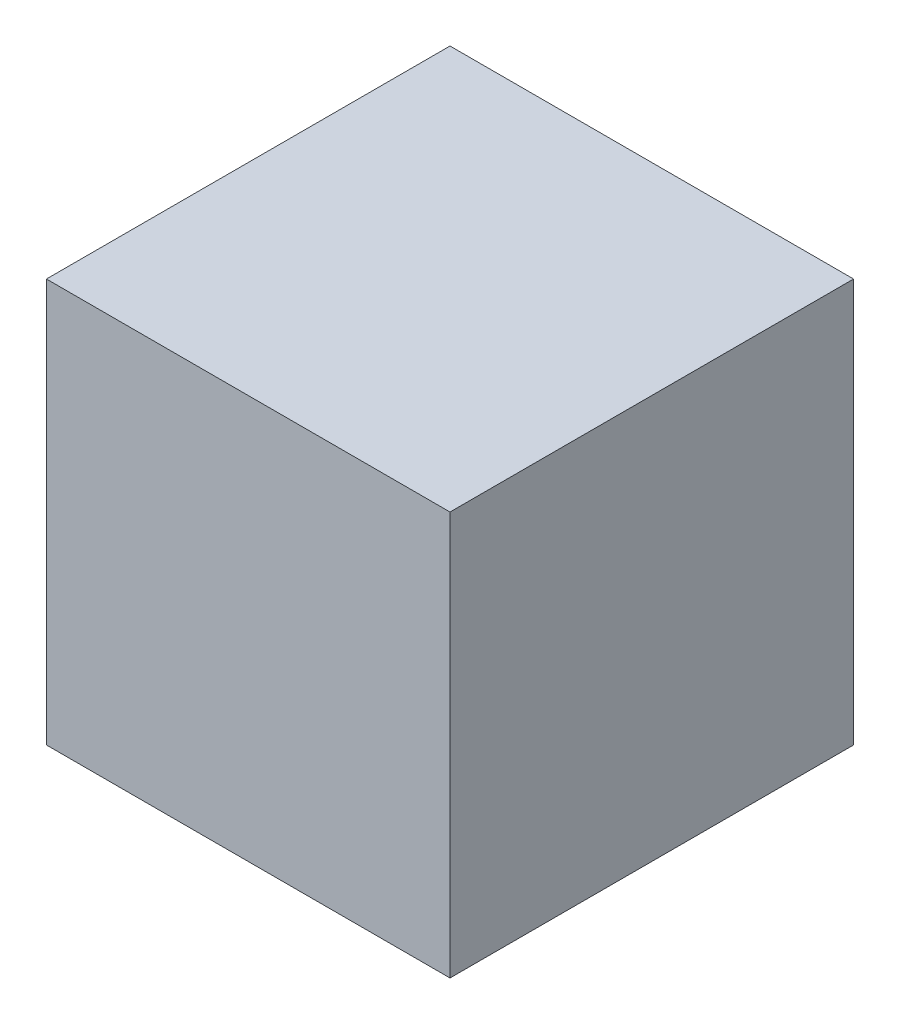
ISO-10303-21;
HEADER;
FILE_DESCRIPTION(('STEP AP214'),'2;1');
FILE_NAME('part.step','',(''),(''),'','','');
FILE_SCHEMA(('AUTOMOTIVE_DESIGN { 1 0 10303 214 1 1 1 1 }'));
ENDSEC;
DATA;
#1=APPLICATION_CONTEXT('core data for automotive mechanical design processes');
#2=APPLICATION_PROTOCOL_DEFINITION('international standard','automotive_design',2000,#1);
#3=PRODUCT_CONTEXT('',#1,'mechanical');
#4=PRODUCT('Part','Part','',(#3));
#5=PRODUCT_RELATED_PRODUCT_CATEGORY('part','',(#4));
#6=PRODUCT_DEFINITION_FORMATION('','',#4);
#7=PRODUCT_DEFINITION_CONTEXT('part definition',#1,'design');
#8=PRODUCT_DEFINITION('design','',#6,#7);
#9=PRODUCT_DEFINITION_SHAPE('','',#8);
#10=(LENGTH_UNIT() NAMED_UNIT(*) SI_UNIT(.MILLI.,.METRE.));
#11=(NAMED_UNIT(*) PLANE_ANGLE_UNIT() SI_UNIT($,.RADIAN.));
#12=(NAMED_UNIT(*) SI_UNIT($,.STERADIAN.) SOLID_ANGLE_UNIT());
#13=UNCERTAINTY_MEASURE_WITH_UNIT(LENGTH_MEASURE(1.E-05),#10,'distance_accuracy_value','');
#14=(GEOMETRIC_REPRESENTATION_CONTEXT(3) GLOBAL_UNCERTAINTY_ASSIGNED_CONTEXT((#13)) GLOBAL_UNIT_ASSIGNED_CONTEXT((#10,
#11,#12)) REPRESENTATION_CONTEXT('',''));
#15=CARTESIAN_POINT('',(0.,0.,0.));
#16=DIRECTION('',(0.,0.,1.));
#17=DIRECTION('',(1.,0.,0.));
#18=AXIS2_PLACEMENT_3D('',#15,#16,#17);
#19=CARTESIAN_POINT('',(0.05,0.05,0.05));
#20=DIRECTION('',(-1.,0.,0.));
#21=DIRECTION('',(0.,-1.,0.));
#22=AXIS2_PLACEMENT_3D('',#19,#20,#21);
#23=PLANE('',#22);
#24=DIRECTION('',(0.,1.,0.));
#25=VECTOR('',#24,1.);
#26=CARTESIAN_POINT('',(0.05,0.05,-0.05));
#27=LINE('',#26,#25);
#28=CARTESIAN_POINT('',(0.05,-0.0499999999999999,-0.05));
#29=VERTEX_POINT('',#28);
#30=CARTESIAN_POINT('',(0.05,0.05,-0.05));
#31=VERTEX_POINT('',#30);
#32=EDGE_CURVE('E100',#29,#31,#27,.T.);
#33=ORIENTED_EDGE('',*,*,#32,.T.);
#34=DIRECTION('',(0.,0.,-1.));
#35=VECTOR('',#34,1.);
#36=CARTESIAN_POINT('',(0.05,0.05,0.05));
#37=LINE('',#36,#35);
#38=CARTESIAN_POINT('',(0.05,0.05,0.05));
#39=VERTEX_POINT('',#38);
#40=EDGE_CURVE('E11',#39,#31,#37,.T.);
#41=ORIENTED_EDGE('',*,*,#40,.F.);
#42=DIRECTION('',(0.,1.,0.));
#43=VECTOR('',#42,1.);
#44=CARTESIAN_POINT('',(0.05,0.05,0.05));
#45=LINE('',#44,#43);
#46=CARTESIAN_POINT('',(0.05,-0.0499999999999999,0.05));
#47=VERTEX_POINT('',#46);
#48=EDGE_CURVE('E88',#47,#39,#45,.T.);
#49=ORIENTED_EDGE('',*,*,#48,.F.);
#50=DIRECTION('',(0.,0.,-1.));
#51=VECTOR('',#50,1.);
#52=CARTESIAN_POINT('',(0.05,-0.0499999999999999,0.05));
#53=LINE('',#52,#51);
#54=EDGE_CURVE('E96',#47,#29,#53,.T.);
#55=ORIENTED_EDGE('',*,*,#54,.T.);
#56=EDGE_LOOP('',(#33,#41,#49,#55));
#57=FACE_BOUND('',#56,.T.);
#58=ADVANCED_FACE('F37',(#57),#23,.F.);
#59=CARTESIAN_POINT('',(-0.05,0.05,0.05));
#60=DIRECTION('',(0.,-1.,0.));
#61=DIRECTION('',(0.,0.,-1.));
#62=AXIS2_PLACEMENT_3D('',#59,#60,#61);
#63=PLANE('',#62);
#64=DIRECTION('',(-1.,0.,0.));
#65=VECTOR('',#64,1.);
#66=CARTESIAN_POINT('',(-0.05,0.05,-0.05));
#67=LINE('',#66,#65);
#68=CARTESIAN_POINT('',(-0.05,0.05,-0.05));
#69=VERTEX_POINT('',#68);
#70=EDGE_CURVE('E92',#31,#69,#67,.T.);
#71=ORIENTED_EDGE('',*,*,#70,.T.);
#72=DIRECTION('',(0.,0.,-1.));
#73=VECTOR('',#72,1.);
#74=CARTESIAN_POINT('',(-0.05,0.05,0.05));
#75=LINE('',#74,#73);
#76=CARTESIAN_POINT('',(-0.05,0.05,0.05));
#77=VERTEX_POINT('',#76);
#78=EDGE_CURVE('E45',#77,#69,#75,.T.);
#79=ORIENTED_EDGE('',*,*,#78,.F.);
#80=DIRECTION('',(-1.,0.,0.));
#81=VECTOR('',#80,1.);
#82=CARTESIAN_POINT('',(-0.05,0.05,0.05));
#83=LINE('',#82,#81);
#84=EDGE_CURVE('E83',#39,#77,#83,.T.);
#85=ORIENTED_EDGE('',*,*,#84,.F.);
#86=ORIENTED_EDGE('',*,*,#40,.T.);
#87=EDGE_LOOP('',(#71,#79,#85,#86));
#88=FACE_BOUND('',#87,.T.);
#89=ADVANCED_FACE('F91',(#88),#63,.F.);
#90=CARTESIAN_POINT('',(-0.05,0.05,0.05));
#91=DIRECTION('',(1.,0.,0.));
#92=DIRECTION('',(0.,1.,0.));
#93=AXIS2_PLACEMENT_3D('',#90,#91,#92);
#94=PLANE('',#93);
#95=DIRECTION('',(0.,-1.,0.));
#96=VECTOR('',#95,1.);
#97=CARTESIAN_POINT('',(-0.05,0.05,-0.05));
#98=LINE('',#97,#96);
#99=CARTESIAN_POINT('',(-0.05,-0.05,-0.05));
#100=VERTEX_POINT('',#99);
#101=EDGE_CURVE('E70',#69,#100,#98,.T.);
#102=ORIENTED_EDGE('',*,*,#101,.T.);
#103=DIRECTION('',(0.,0.,-1.));
#104=VECTOR('',#103,1.);
#105=CARTESIAN_POINT('',(-0.05,-0.05,0.05));
#106=LINE('',#105,#104);
#107=CARTESIAN_POINT('',(-0.05,-0.05,0.05));
#108=VERTEX_POINT('',#107);
#109=EDGE_CURVE('E93',#108,#100,#106,.T.);
#110=ORIENTED_EDGE('',*,*,#109,.F.);
#111=DIRECTION('',(0.,-1.,0.));
#112=VECTOR('',#111,1.);
#113=CARTESIAN_POINT('',(-0.05,0.05,0.05));
#114=LINE('',#113,#112);
#115=EDGE_CURVE('E86',#77,#108,#114,.T.);
#116=ORIENTED_EDGE('',*,*,#115,.F.);
#117=ORIENTED_EDGE('',*,*,#78,.T.);
#118=EDGE_LOOP('',(#102,#110,#116,#117));
#119=FACE_BOUND('',#118,.T.);
#120=ADVANCED_FACE('F94',(#119),#94,.F.);
#121=CARTESIAN_POINT('',(-0.05,-0.05,0.05));
#122=DIRECTION('',(0.,1.,0.));
#123=DIRECTION('',(-1.,0.,0.));
#124=AXIS2_PLACEMENT_3D('',#121,#122,#123);
#125=PLANE('',#124);
#126=DIRECTION('',(1.,0.,0.));
#127=VECTOR('',#126,1.);
#128=CARTESIAN_POINT('',(-0.05,-0.05,-0.05));
#129=LINE('',#128,#127);
#130=EDGE_CURVE('E76',#100,#29,#129,.T.);
#131=ORIENTED_EDGE('',*,*,#130,.T.);
#132=ORIENTED_EDGE('',*,*,#54,.F.);
#133=DIRECTION('',(1.,0.,0.));
#134=VECTOR('',#133,1.);
#135=CARTESIAN_POINT('',(-0.05,-0.05,0.05));
#136=LINE('',#135,#134);
#137=EDGE_CURVE('E53',#108,#47,#136,.T.);
#138=ORIENTED_EDGE('',*,*,#137,.F.);
#139=ORIENTED_EDGE('',*,*,#109,.T.);
#140=EDGE_LOOP('',(#131,#132,#138,#139));
#141=FACE_BOUND('',#140,.T.);
#142=ADVANCED_FACE('F107',(#141),#125,.F.);
#143=CARTESIAN_POINT('',(0.,0.,0.05));
#144=DIRECTION('',(0.,0.,1.));
#145=DIRECTION('',(1.,0.,0.));
#146=AXIS2_PLACEMENT_3D('',#143,#144,#145);
#147=PLANE('',#146);
#148=ORIENTED_EDGE('',*,*,#48,.T.);
#149=ORIENTED_EDGE('',*,*,#84,.T.);
#150=ORIENTED_EDGE('',*,*,#115,.T.);
#151=ORIENTED_EDGE('',*,*,#137,.T.);
#152=EDGE_LOOP('',(#148,#149,#150,#151));
#153=FACE_BOUND('',#152,.T.);
#154=ADVANCED_FACE('F84',(#153),#147,.T.);
#155=CARTESIAN_POINT('',(0.,0.,-0.05));
#156=DIRECTION('',(0.,0.,1.));
#157=DIRECTION('',(1.,0.,0.));
#158=AXIS2_PLACEMENT_3D('',#155,#156,#157);
#159=PLANE('',#158);
#160=ORIENTED_EDGE('',*,*,#32,.F.);
#161=ORIENTED_EDGE('',*,*,#130,.F.);
#162=ORIENTED_EDGE('',*,*,#101,.F.);
#163=ORIENTED_EDGE('',*,*,#70,.F.);
#164=EDGE_LOOP('',(#160,#161,#162,#163));
#165=FACE_BOUND('',#164,.T.);
#166=ADVANCED_FACE('F110',(#165),#159,.F.);
#167=CLOSED_SHELL('',(#58,#89,#120,#142,#154,#166));
#168=MANIFOLD_SOLID_BREP('B2',#167);
#169=ADVANCED_BREP_SHAPE_REPRESENTATION('',(#18,#168),#14);
#170=SHAPE_DEFINITION_REPRESENTATION(#9,#169);
ENDSEC;
END-ISO-10303-21;
